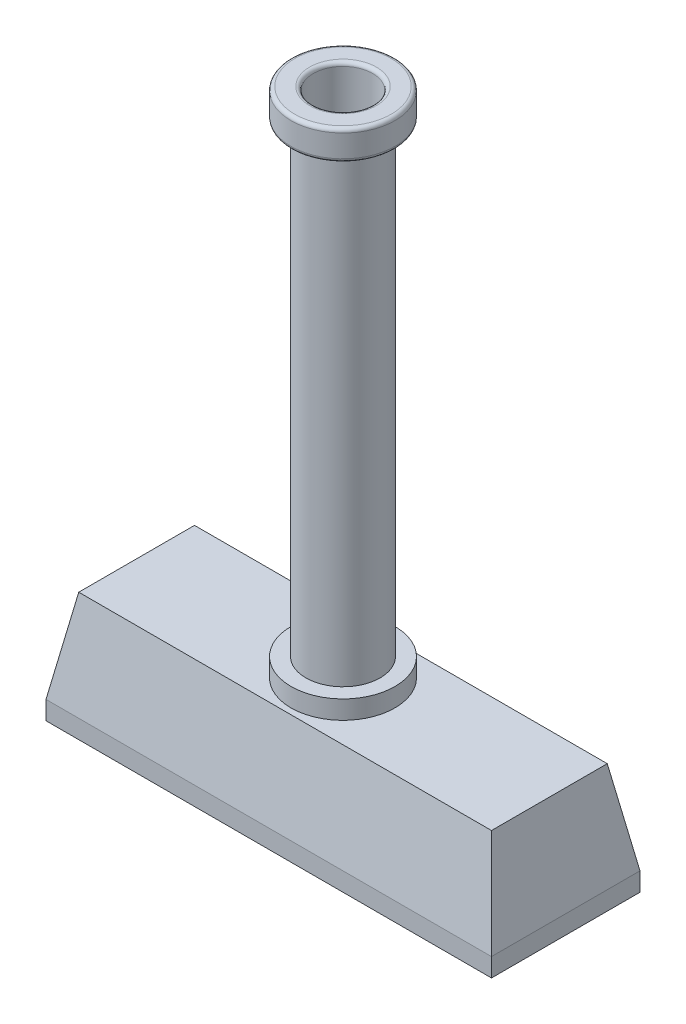
ISO-10303-21;
HEADER;
FILE_DESCRIPTION(('STEP AP214'),'2;1');
FILE_NAME('part.step','',(''),(''),'','','');
FILE_SCHEMA(('AUTOMOTIVE_DESIGN { 1 0 10303 214 1 1 1 1 }'));
ENDSEC;
DATA;
#1=APPLICATION_CONTEXT('core data for automotive mechanical design processes');
#2=APPLICATION_PROTOCOL_DEFINITION('international standard','automotive_design',2000,#1);
#3=PRODUCT_CONTEXT('',#1,'mechanical');
#4=PRODUCT('Part','Part','',(#3));
#5=PRODUCT_RELATED_PRODUCT_CATEGORY('part','',(#4));
#6=PRODUCT_DEFINITION_FORMATION('','',#4);
#7=PRODUCT_DEFINITION_CONTEXT('part definition',#1,'design');
#8=PRODUCT_DEFINITION('design','',#6,#7);
#9=PRODUCT_DEFINITION_SHAPE('','',#8);
#10=(LENGTH_UNIT() NAMED_UNIT(*) SI_UNIT(.MILLI.,.METRE.));
#11=(NAMED_UNIT(*) PLANE_ANGLE_UNIT() SI_UNIT($,.RADIAN.));
#12=(NAMED_UNIT(*) SI_UNIT($,.STERADIAN.) SOLID_ANGLE_UNIT());
#13=UNCERTAINTY_MEASURE_WITH_UNIT(LENGTH_MEASURE(1.E-05),#10,'distance_accuracy_value','');
#14=(GEOMETRIC_REPRESENTATION_CONTEXT(3) GLOBAL_UNCERTAINTY_ASSIGNED_CONTEXT((#13)) GLOBAL_UNIT_ASSIGNED_CONTEXT((#10,
#11,#12)) REPRESENTATION_CONTEXT('',''));
#15=CARTESIAN_POINT('',(0.,0.,0.));
#16=DIRECTION('',(0.,0.,1.));
#17=DIRECTION('',(1.,0.,0.));
#18=AXIS2_PLACEMENT_3D('',#15,#16,#17);
#19=CARTESIAN_POINT('',(60.,0.,-20.));
#20=DIRECTION('',(0.984807753012208,0.17364817766693,0.));
#21=DIRECTION('',(-0.17364817766693,0.984807753012208,0.));
#22=AXIS2_PLACEMENT_3D('',#19,#20,#21);
#23=PLANE('',#22);
#24=DIRECTION('',(0.,0.,-1.));
#25=VECTOR('',#24,1.);
#26=CARTESIAN_POINT('',(60.,0.,-20.));
#27=LINE('',#26,#25);
#28=CARTESIAN_POINT('',(60.,0.,20.));
#29=VERTEX_POINT('',#28);
#30=CARTESIAN_POINT('',(60.,0.,-20.));
#31=VERTEX_POINT('',#30);
#32=EDGE_CURVE('E121',#29,#31,#27,.T.);
#33=ORIENTED_EDGE('',*,*,#32,.T.);
#34=DIRECTION('',(0.171087869746036,-0.970287525247814,-0.171087869746036));
#35=VECTOR('',#34,1.);
#36=CARTESIAN_POINT('',(56.4874728990916,19.9205310882961,-16.4874728990916));
#37=LINE('',#36,#35);
#38=CARTESIAN_POINT('',(55.5918254822884,25.,-15.5918254822884));
#39=VERTEX_POINT('',#38);
#40=EDGE_CURVE('E147',#39,#31,#37,.T.);
#41=ORIENTED_EDGE('',*,*,#40,.F.);
#42=DIRECTION('',(0.,0.,1.));
#43=VECTOR('',#42,1.);
#44=CARTESIAN_POINT('',(55.5918254822884,25.,-20.));
#45=LINE('',#44,#43);
#46=CARTESIAN_POINT('',(55.5918254822884,25.,15.5918254822884));
#47=VERTEX_POINT('',#46);
#48=EDGE_CURVE('E161',#47,#39,#45,.F.);
#49=ORIENTED_EDGE('',*,*,#48,.F.);
#50=DIRECTION('',(0.171087869746036,-0.970287525247814,0.171087869746036));
#51=VECTOR('',#50,1.);
#52=CARTESIAN_POINT('',(58.8291576330306,6.64017702943205,18.8291576330305));
#53=LINE('',#52,#51);
#54=EDGE_CURVE('E166',#47,#29,#53,.T.);
#55=ORIENTED_EDGE('',*,*,#54,.T.);
#56=EDGE_LOOP('',(#33,#41,#49,#55));
#57=FACE_BOUND('',#56,.T.);
#58=ADVANCED_FACE('F43',(#57),#23,.T.);
#59=CARTESIAN_POINT('',(-60.,0.,-20.));
#60=DIRECTION('',(0.,0.17364817766693,-0.984807753012208));
#61=DIRECTION('',(0.,0.984807753012208,0.17364817766693));
#62=AXIS2_PLACEMENT_3D('',#59,#60,#61);
#63=PLANE('',#62);
#64=DIRECTION('',(-1.,0.,0.));
#65=VECTOR('',#64,1.);
#66=CARTESIAN_POINT('',(-60.,0.,-20.));
#67=LINE('',#66,#65);
#68=CARTESIAN_POINT('',(-60.,0.,-20.));
#69=VERTEX_POINT('',#68);
#70=EDGE_CURVE('E150',#31,#69,#67,.T.);
#71=ORIENTED_EDGE('',*,*,#70,.T.);
#72=DIRECTION('',(-0.171087869746036,-0.970287525247814,-0.171087869746036));
#73=VECTOR('',#72,1.);
#74=CARTESIAN_POINT('',(-60.,0.,-20.));
#75=LINE('',#74,#73);
#76=CARTESIAN_POINT('',(-55.5918254822884,25.,-15.5918254822884));
#77=VERTEX_POINT('',#76);
#78=EDGE_CURVE('E165',#77,#69,#75,.T.);
#79=ORIENTED_EDGE('',*,*,#78,.F.);
#80=DIRECTION('',(1.,0.,0.));
#81=VECTOR('',#80,1.);
#82=CARTESIAN_POINT('',(-60.,25.,-15.5918254822884));
#83=LINE('',#82,#81);
#84=EDGE_CURVE('E179',#39,#77,#83,.F.);
#85=ORIENTED_EDGE('',*,*,#84,.F.);
#86=ORIENTED_EDGE('',*,*,#40,.T.);
#87=EDGE_LOOP('',(#71,#79,#85,#86));
#88=FACE_BOUND('',#87,.T.);
#89=ADVANCED_FACE('F246',(#88),#63,.T.);
#90=CARTESIAN_POINT('',(-60.,0.,-20.));
#91=DIRECTION('',(-0.984807753012208,0.17364817766693,0.));
#92=DIRECTION('',(-0.17364817766693,-0.984807753012208,0.));
#93=AXIS2_PLACEMENT_3D('',#90,#91,#92);
#94=PLANE('',#93);
#95=DIRECTION('',(0.,0.,1.));
#96=VECTOR('',#95,1.);
#97=CARTESIAN_POINT('',(-60.,0.,-20.));
#98=LINE('',#97,#96);
#99=CARTESIAN_POINT('',(-60.,0.,20.));
#100=VERTEX_POINT('',#99);
#101=EDGE_CURVE('E154',#69,#100,#98,.T.);
#102=ORIENTED_EDGE('',*,*,#101,.T.);
#103=DIRECTION('',(-0.171087869746035,-0.970287525247814,0.171087869746036));
#104=VECTOR('',#103,1.);
#105=CARTESIAN_POINT('',(-60.,0.,20.));
#106=LINE('',#105,#104);
#107=CARTESIAN_POINT('',(-55.5918254822883,25.,15.5918254822884));
#108=VERTEX_POINT('',#107);
#109=EDGE_CURVE('E170',#108,#100,#106,.T.);
#110=ORIENTED_EDGE('',*,*,#109,.F.);
#111=DIRECTION('',(0.,0.,-1.));
#112=VECTOR('',#111,1.);
#113=CARTESIAN_POINT('',(-55.5918254822884,25.,-20.));
#114=LINE('',#113,#112);
#115=EDGE_CURVE('E64',#77,#108,#114,.F.);
#116=ORIENTED_EDGE('',*,*,#115,.F.);
#117=ORIENTED_EDGE('',*,*,#78,.T.);
#118=EDGE_LOOP('',(#102,#110,#116,#117));
#119=FACE_BOUND('',#118,.T.);
#120=ADVANCED_FACE('F253',(#119),#94,.T.);
#121=CARTESIAN_POINT('',(-60.,0.,20.));
#122=DIRECTION('',(0.,0.17364817766693,0.984807753012208));
#123=DIRECTION('',(0.,-0.984807753012208,0.17364817766693));
#124=AXIS2_PLACEMENT_3D('',#121,#122,#123);
#125=PLANE('',#124);
#126=DIRECTION('',(1.,0.,0.));
#127=VECTOR('',#126,1.);
#128=CARTESIAN_POINT('',(-60.,0.,20.));
#129=LINE('',#128,#127);
#130=EDGE_CURVE('E158',#100,#29,#129,.T.);
#131=ORIENTED_EDGE('',*,*,#130,.T.);
#132=ORIENTED_EDGE('',*,*,#54,.F.);
#133=DIRECTION('',(-1.,0.,0.));
#134=VECTOR('',#133,1.);
#135=CARTESIAN_POINT('',(-60.,25.,15.5918254822884));
#136=LINE('',#135,#134);
#137=EDGE_CURVE('E59',#108,#47,#136,.F.);
#138=ORIENTED_EDGE('',*,*,#137,.F.);
#139=ORIENTED_EDGE('',*,*,#109,.T.);
#140=EDGE_LOOP('',(#131,#132,#138,#139));
#141=FACE_BOUND('',#140,.T.);
#142=ADVANCED_FACE('F260',(#141),#125,.T.);
#143=CARTESIAN_POINT('',(0.,25.,0.));
#144=DIRECTION('',(0.,1.,0.));
#145=DIRECTION('',(0.,0.,1.));
#146=AXIS2_PLACEMENT_3D('',#143,#144,#145);
#147=PLANE('',#146);
#148=CARTESIAN_POINT('',(0.,25.,0.));
#149=DIRECTION('',(0.,1.,0.));
#150=DIRECTION('',(0.,0.,1.));
#151=AXIS2_PLACEMENT_3D('',#148,#149,#150);
#152=CIRCLE('',#151,14.);
#153=CARTESIAN_POINT('',(0.,25.,14.));
#154=VERTEX_POINT('',#153);
#155=EDGE_CURVE('E140',#154,#154,#152,.T.);
#156=ORIENTED_EDGE('',*,*,#155,.F.);
#157=EDGE_LOOP('',(#156));
#158=FACE_BOUND('',#157,.T.);
#159=ORIENTED_EDGE('',*,*,#48,.T.);
#160=ORIENTED_EDGE('',*,*,#84,.T.);
#161=ORIENTED_EDGE('',*,*,#115,.T.);
#162=ORIENTED_EDGE('',*,*,#137,.T.);
#163=EDGE_LOOP('',(#159,#160,#161,#162));
#164=FACE_BOUND('',#163,.T.);
#165=ADVANCED_FACE('F258',(#158,#164),#147,.T.);
#166=CARTESIAN_POINT('',(0.,30.,0.));
#167=DIRECTION('',(0.,-1.,0.));
#168=DIRECTION('',(0.,0.,-1.));
#169=AXIS2_PLACEMENT_3D('',#166,#167,#168);
#170=CYLINDRICAL_SURFACE('',#169,14.);
#171=CARTESIAN_POINT('',(0.,30.,0.));
#172=DIRECTION('',(0.,1.,0.));
#173=DIRECTION('',(0.,0.,1.));
#174=AXIS2_PLACEMENT_3D('',#171,#172,#173);
#175=CIRCLE('',#174,14.);
#176=CARTESIAN_POINT('',(0.,30.,14.));
#177=VERTEX_POINT('',#176);
#178=EDGE_CURVE('E129',#177,#177,#175,.T.);
#179=ORIENTED_EDGE('',*,*,#178,.F.);
#180=EDGE_LOOP('',(#179));
#181=FACE_BOUND('',#180,.T.);
#182=ORIENTED_EDGE('',*,*,#155,.T.);
#183=EDGE_LOOP('',(#182));
#184=FACE_BOUND('',#183,.T.);
#185=ADVANCED_FACE('F379',(#181,#184),#170,.T.);
#186=CARTESIAN_POINT('',(0.,30.,0.));
#187=DIRECTION('',(0.,1.,0.));
#188=DIRECTION('',(0.,0.,1.));
#189=AXIS2_PLACEMENT_3D('',#186,#187,#188);
#190=PLANE('',#189);
#191=CARTESIAN_POINT('',(0.,30.,0.));
#192=DIRECTION('',(0.,1.,0.));
#193=DIRECTION('',(0.,0.,1.));
#194=AXIS2_PLACEMENT_3D('',#191,#192,#193);
#195=CIRCLE('',#194,10.);
#196=CARTESIAN_POINT('',(0.,30.,10.));
#197=VERTEX_POINT('',#196);
#198=EDGE_CURVE('E135',#197,#197,#195,.T.);
#199=ORIENTED_EDGE('',*,*,#198,.F.);
#200=EDGE_LOOP('',(#199));
#201=FACE_BOUND('',#200,.T.);
#202=ORIENTED_EDGE('',*,*,#178,.T.);
#203=EDGE_LOOP('',(#202));
#204=FACE_BOUND('',#203,.T.);
#205=ADVANCED_FACE('F371',(#201,#204),#190,.T.);
#206=CARTESIAN_POINT('',(0.,155.,0.));
#207=DIRECTION('',(0.,-1.,0.));
#208=DIRECTION('',(0.,0.,-1.));
#209=AXIS2_PLACEMENT_3D('',#206,#207,#208);
#210=CYLINDRICAL_SURFACE('',#209,10.);
#211=CARTESIAN_POINT('',(0.,154.,0.));
#212=DIRECTION('',(0.,1.,0.));
#213=DIRECTION('',(0.,0.,1.));
#214=AXIS2_PLACEMENT_3D('',#211,#212,#213);
#215=CIRCLE('',#214,10.);
#216=CARTESIAN_POINT('',(0.,154.,10.));
#217=VERTEX_POINT('',#216);
#218=EDGE_CURVE('E11',#217,#217,#215,.F.);
#219=ORIENTED_EDGE('',*,*,#218,.T.);
#220=EDGE_LOOP('',(#219));
#221=FACE_BOUND('',#220,.T.);
#222=ORIENTED_EDGE('',*,*,#198,.T.);
#223=EDGE_LOOP('',(#222));
#224=FACE_BOUND('',#223,.T.);
#225=ADVANCED_FACE('F227',(#221,#224),#210,.T.);
#226=CARTESIAN_POINT('',(0.,163.,0.));
#227=DIRECTION('',(0.,-1.,0.));
#228=DIRECTION('',(0.,0.,-1.));
#229=AXIS2_PLACEMENT_3D('',#226,#227,#228);
#230=CYLINDRICAL_SURFACE('',#229,14.);
#231=CARTESIAN_POINT('',(0.,156.,0.));
#232=DIRECTION('',(0.,1.,0.));
#233=DIRECTION('',(0.,0.,1.));
#234=AXIS2_PLACEMENT_3D('',#231,#232,#233);
#235=CIRCLE('',#234,14.);
#236=CARTESIAN_POINT('',(0.,156.,14.));
#237=VERTEX_POINT('',#236);
#238=EDGE_CURVE('E201',#237,#237,#235,.T.);
#239=ORIENTED_EDGE('',*,*,#238,.T.);
#240=EDGE_LOOP('',(#239));
#241=FACE_BOUND('',#240,.T.);
#242=CARTESIAN_POINT('',(0.,162.,0.));
#243=DIRECTION('',(0.,1.,0.));
#244=DIRECTION('',(0.,0.,1.));
#245=AXIS2_PLACEMENT_3D('',#242,#243,#244);
#246=CIRCLE('',#245,14.);
#247=CARTESIAN_POINT('',(0.,162.,14.));
#248=VERTEX_POINT('',#247);
#249=EDGE_CURVE('E197',#248,#248,#246,.F.);
#250=ORIENTED_EDGE('',*,*,#249,.T.);
#251=EDGE_LOOP('',(#250));
#252=FACE_BOUND('',#251,.T.);
#253=ADVANCED_FACE('F223',(#241,#252),#230,.T.);
#254=CARTESIAN_POINT('',(0.,163.,0.));
#255=DIRECTION('',(0.,1.,0.));
#256=DIRECTION('',(0.,0.,1.));
#257=AXIS2_PLACEMENT_3D('',#254,#255,#256);
#258=PLANE('',#257);
#259=CARTESIAN_POINT('',(0.,163.,0.));
#260=DIRECTION('',(0.,1.,0.));
#261=DIRECTION('',(0.,0.,1.));
#262=AXIS2_PLACEMENT_3D('',#259,#260,#261);
#263=CIRCLE('',#262,9.);
#264=CARTESIAN_POINT('',(0.,163.,9.));
#265=VERTEX_POINT('',#264);
#266=EDGE_CURVE('E193',#265,#265,#263,.F.);
#267=ORIENTED_EDGE('',*,*,#266,.T.);
#268=EDGE_LOOP('',(#267));
#269=FACE_BOUND('',#268,.T.);
#270=CARTESIAN_POINT('',(0.,163.,0.));
#271=DIRECTION('',(0.,1.,0.));
#272=DIRECTION('',(0.,0.,1.));
#273=AXIS2_PLACEMENT_3D('',#270,#271,#272);
#274=CIRCLE('',#273,13.);
#275=CARTESIAN_POINT('',(0.,163.,13.));
#276=VERTEX_POINT('',#275);
#277=EDGE_CURVE('E189',#276,#276,#274,.T.);
#278=ORIENTED_EDGE('',*,*,#277,.T.);
#279=EDGE_LOOP('',(#278));
#280=FACE_BOUND('',#279,.T.);
#281=ADVANCED_FACE('F226',(#269,#280),#258,.T.);
#282=CARTESIAN_POINT('',(0.,155.,0.));
#283=DIRECTION('',(0.,1.,0.));
#284=DIRECTION('',(0.,0.,1.));
#285=AXIS2_PLACEMENT_3D('',#282,#283,#284);
#286=PLANE('',#285);
#287=CARTESIAN_POINT('',(0.,155.,0.));
#288=DIRECTION('',(0.,1.,0.));
#289=DIRECTION('',(0.,0.,1.));
#290=AXIS2_PLACEMENT_3D('',#287,#288,#289);
#291=CIRCLE('',#290,13.);
#292=CARTESIAN_POINT('',(0.,155.,13.));
#293=VERTEX_POINT('',#292);
#294=EDGE_CURVE('E52',#293,#293,#291,.F.);
#295=ORIENTED_EDGE('',*,*,#294,.T.);
#296=EDGE_LOOP('',(#295));
#297=FACE_BOUND('',#296,.T.);
#298=CARTESIAN_POINT('',(0.,155.,0.));
#299=DIRECTION('',(0.,1.,0.));
#300=DIRECTION('',(0.,0.,1.));
#301=AXIS2_PLACEMENT_3D('',#298,#299,#300);
#302=CIRCLE('',#301,11.);
#303=CARTESIAN_POINT('',(0.,155.,11.));
#304=VERTEX_POINT('',#303);
#305=EDGE_CURVE('E205',#304,#304,#302,.T.);
#306=ORIENTED_EDGE('',*,*,#305,.T.);
#307=EDGE_LOOP('',(#306));
#308=FACE_BOUND('',#307,.T.);
#309=ADVANCED_FACE('F212',(#297,#308),#286,.F.);
#310=CARTESIAN_POINT('',(0.,13.,0.));
#311=DIRECTION('',(0.,1.,0.));
#312=DIRECTION('',(0.,0.,1.));
#313=AXIS2_PLACEMENT_3D('',#310,#311,#312);
#314=CYLINDRICAL_SURFACE('',#313,8.);
#315=CARTESIAN_POINT('',(0.,162.,0.));
#316=DIRECTION('',(0.,1.,0.));
#317=DIRECTION('',(0.,0.,1.));
#318=AXIS2_PLACEMENT_3D('',#315,#316,#317);
#319=CIRCLE('',#318,8.);
#320=CARTESIAN_POINT('',(0.,162.,8.));
#321=VERTEX_POINT('',#320);
#322=EDGE_CURVE('E139',#321,#321,#319,.T.);
#323=ORIENTED_EDGE('',*,*,#322,.T.);
#324=EDGE_LOOP('',(#323));
#325=FACE_BOUND('',#324,.T.);
#326=CARTESIAN_POINT('',(0.,13.,0.));
#327=DIRECTION('',(0.,1.,0.));
#328=DIRECTION('',(0.,0.,1.));
#329=AXIS2_PLACEMENT_3D('',#326,#327,#328);
#330=CIRCLE('',#329,8.);
#331=CARTESIAN_POINT('',(0.,13.,8.));
#332=VERTEX_POINT('',#331);
#333=EDGE_CURVE('E124',#332,#332,#330,.T.);
#334=ORIENTED_EDGE('',*,*,#333,.F.);
#335=EDGE_LOOP('',(#334));
#336=FACE_BOUND('',#335,.T.);
#337=ADVANCED_FACE('F242',(#325,#336),#314,.F.);
#338=CARTESIAN_POINT('',(0.,13.,0.));
#339=DIRECTION('',(0.,1.,0.));
#340=DIRECTION('',(0.,0.,1.));
#341=AXIS2_PLACEMENT_3D('',#338,#339,#340);
#342=PLANE('',#341);
#343=ORIENTED_EDGE('',*,*,#333,.T.);
#344=EDGE_LOOP('',(#343));
#345=FACE_BOUND('',#344,.T.);
#346=ADVANCED_FACE('F267',(#345),#342,.T.);
#347=CARTESIAN_POINT('',(0.,162.,0.));
#348=DIRECTION('',(0.,1.,0.));
#349=DIRECTION('',(0.,0.,1.));
#350=AXIS2_PLACEMENT_3D('',#347,#348,#349);
#351=TOROIDAL_SURFACE('',#350,9.,1.);
#352=ORIENTED_EDGE('',*,*,#266,.F.);
#353=EDGE_LOOP('',(#352));
#354=FACE_BOUND('',#353,.T.);
#355=ORIENTED_EDGE('',*,*,#322,.F.);
#356=EDGE_LOOP('',(#355));
#357=FACE_BOUND('',#356,.T.);
#358=ADVANCED_FACE('F219',(#354,#357),#351,.T.);
#359=CARTESIAN_POINT('',(0.,156.,0.));
#360=DIRECTION('',(0.,1.,0.));
#361=DIRECTION('',(0.,0.,1.));
#362=AXIS2_PLACEMENT_3D('',#359,#360,#361);
#363=TOROIDAL_SURFACE('',#362,13.,1.);
#364=ORIENTED_EDGE('',*,*,#294,.F.);
#365=EDGE_LOOP('',(#364));
#366=FACE_BOUND('',#365,.T.);
#367=ORIENTED_EDGE('',*,*,#238,.F.);
#368=EDGE_LOOP('',(#367));
#369=FACE_BOUND('',#368,.T.);
#370=ADVANCED_FACE('F215',(#366,#369),#363,.T.);
#371=CARTESIAN_POINT('',(0.,162.,0.));
#372=DIRECTION('',(0.,1.,0.));
#373=DIRECTION('',(0.,0.,1.));
#374=AXIS2_PLACEMENT_3D('',#371,#372,#373);
#375=TOROIDAL_SURFACE('',#374,13.,1.);
#376=ORIENTED_EDGE('',*,*,#249,.F.);
#377=EDGE_LOOP('',(#376));
#378=FACE_BOUND('',#377,.T.);
#379=ORIENTED_EDGE('',*,*,#277,.F.);
#380=EDGE_LOOP('',(#379));
#381=FACE_BOUND('',#380,.T.);
#382=ADVANCED_FACE('F218',(#378,#381),#375,.T.);
#383=CARTESIAN_POINT('',(0.,154.,0.));
#384=DIRECTION('',(0.,1.,0.));
#385=DIRECTION('',(0.,0.,1.));
#386=AXIS2_PLACEMENT_3D('',#383,#384,#385);
#387=TOROIDAL_SURFACE('',#386,11.,1.);
#388=ORIENTED_EDGE('',*,*,#218,.F.);
#389=EDGE_LOOP('',(#388));
#390=FACE_BOUND('',#389,.T.);
#391=ORIENTED_EDGE('',*,*,#305,.F.);
#392=EDGE_LOOP('',(#391));
#393=FACE_BOUND('',#392,.T.);
#394=ADVANCED_FACE('F45',(#390,#393),#387,.F.);
#395=CARTESIAN_POINT('',(60.,-5.,20.));
#396=DIRECTION('',(-1.,0.,0.));
#397=DIRECTION('',(0.,0.,1.));
#398=AXIS2_PLACEMENT_3D('',#395,#396,#397);
#399=PLANE('',#398);
#400=ORIENTED_EDGE('',*,*,#32,.F.);
#401=DIRECTION('',(0.,1.,0.));
#402=VECTOR('',#401,1.);
#403=CARTESIAN_POINT('',(60.,-5.,20.));
#404=LINE('',#403,#402);
#405=CARTESIAN_POINT('',(60.,-5.,20.));
#406=VERTEX_POINT('',#405);
#407=EDGE_CURVE('E100',#406,#29,#404,.T.);
#408=ORIENTED_EDGE('',*,*,#407,.F.);
#409=DIRECTION('',(0.,0.,1.));
#410=VECTOR('',#409,1.);
#411=CARTESIAN_POINT('',(60.,-5.,20.));
#412=LINE('',#411,#410);
#413=CARTESIAN_POINT('',(60.,-5.,-20.));
#414=VERTEX_POINT('',#413);
#415=EDGE_CURVE('E108',#414,#406,#412,.T.);
#416=ORIENTED_EDGE('',*,*,#415,.F.);
#417=DIRECTION('',(0.,1.,0.));
#418=VECTOR('',#417,1.);
#419=CARTESIAN_POINT('',(60.,-5.,-20.));
#420=LINE('',#419,#418);
#421=EDGE_CURVE('E483',#414,#31,#420,.T.);
#422=ORIENTED_EDGE('',*,*,#421,.T.);
#423=EDGE_LOOP('',(#400,#408,#416,#422));
#424=FACE_BOUND('',#423,.T.);
#425=ADVANCED_FACE('F119',(#424),#399,.F.);
#426=CARTESIAN_POINT('',(-60.,-5.,20.));
#427=DIRECTION('',(0.,0.,-1.));
#428=DIRECTION('',(-1.,0.,0.));
#429=AXIS2_PLACEMENT_3D('',#426,#427,#428);
#430=PLANE('',#429);
#431=ORIENTED_EDGE('',*,*,#130,.F.);
#432=DIRECTION('',(0.,1.,0.));
#433=VECTOR('',#432,1.);
#434=CARTESIAN_POINT('',(-60.,-5.,20.));
#435=LINE('',#434,#433);
#436=CARTESIAN_POINT('',(-60.,-5.,20.));
#437=VERTEX_POINT('',#436);
#438=EDGE_CURVE('E103',#437,#100,#435,.T.);
#439=ORIENTED_EDGE('',*,*,#438,.F.);
#440=DIRECTION('',(-1.,0.,0.));
#441=VECTOR('',#440,1.);
#442=CARTESIAN_POINT('',(-60.,-5.,20.));
#443=LINE('',#442,#441);
#444=EDGE_CURVE('E96',#406,#437,#443,.T.);
#445=ORIENTED_EDGE('',*,*,#444,.F.);
#446=ORIENTED_EDGE('',*,*,#407,.T.);
#447=EDGE_LOOP('',(#431,#439,#445,#446));
#448=FACE_BOUND('',#447,.T.);
#449=ADVANCED_FACE('F98',(#448),#430,.F.);
#450=CARTESIAN_POINT('',(-60.,-5.,20.));
#451=DIRECTION('',(1.,0.,0.));
#452=DIRECTION('',(0.,0.,-1.));
#453=AXIS2_PLACEMENT_3D('',#450,#451,#452);
#454=PLANE('',#453);
#455=ORIENTED_EDGE('',*,*,#101,.F.);
#456=DIRECTION('',(0.,1.,0.));
#457=VECTOR('',#456,1.);
#458=CARTESIAN_POINT('',(-60.,-5.,-20.));
#459=LINE('',#458,#457);
#460=CARTESIAN_POINT('',(-60.,-5.,-20.));
#461=VERTEX_POINT('',#460);
#462=EDGE_CURVE('E131',#461,#69,#459,.T.);
#463=ORIENTED_EDGE('',*,*,#462,.F.);
#464=DIRECTION('',(0.,0.,-1.));
#465=VECTOR('',#464,1.);
#466=CARTESIAN_POINT('',(-60.,-5.,20.));
#467=LINE('',#466,#465);
#468=EDGE_CURVE('E107',#437,#461,#467,.T.);
#469=ORIENTED_EDGE('',*,*,#468,.F.);
#470=ORIENTED_EDGE('',*,*,#438,.T.);
#471=EDGE_LOOP('',(#455,#463,#469,#470));
#472=FACE_BOUND('',#471,.T.);
#473=ADVANCED_FACE('F288',(#472),#454,.F.);
#474=CARTESIAN_POINT('',(-60.,-5.,-20.));
#475=DIRECTION('',(0.,0.,1.));
#476=DIRECTION('',(1.,0.,0.));
#477=AXIS2_PLACEMENT_3D('',#474,#475,#476);
#478=PLANE('',#477);
#479=ORIENTED_EDGE('',*,*,#70,.F.);
#480=ORIENTED_EDGE('',*,*,#421,.F.);
#481=DIRECTION('',(1.,0.,0.));
#482=VECTOR('',#481,1.);
#483=CARTESIAN_POINT('',(-60.,-5.,-20.));
#484=LINE('',#483,#482);
#485=EDGE_CURVE('E113',#461,#414,#484,.T.);
#486=ORIENTED_EDGE('',*,*,#485,.F.);
#487=ORIENTED_EDGE('',*,*,#462,.T.);
#488=EDGE_LOOP('',(#479,#480,#486,#487));
#489=FACE_BOUND('',#488,.T.);
#490=ADVANCED_FACE('F291',(#489),#478,.F.);
#491=CARTESIAN_POINT('',(0.,-5.,0.));
#492=DIRECTION('',(0.,-1.,0.));
#493=DIRECTION('',(0.,0.,-1.));
#494=AXIS2_PLACEMENT_3D('',#491,#492,#493);
#495=PLANE('',#494);
#496=ORIENTED_EDGE('',*,*,#415,.T.);
#497=ORIENTED_EDGE('',*,*,#444,.T.);
#498=ORIENTED_EDGE('',*,*,#468,.T.);
#499=ORIENTED_EDGE('',*,*,#485,.T.);
#500=EDGE_LOOP('',(#496,#497,#498,#499));
#501=FACE_BOUND('',#500,.T.);
#502=ADVANCED_FACE('F111',(#501),#495,.T.);
#503=CLOSED_SHELL('',(#58,#89,#120,#142,#165,#185,#205,#225,#253,#281,#309,#337,#346,#358,#370,
#382,#394,#425,#449,#473,#490,#502));
#504=MANIFOLD_SOLID_BREP('B2',#503);
#505=ADVANCED_BREP_SHAPE_REPRESENTATION('',(#18,#504),#14);
#506=SHAPE_DEFINITION_REPRESENTATION(#9,#505);
ENDSEC;
END-ISO-10303-21;
